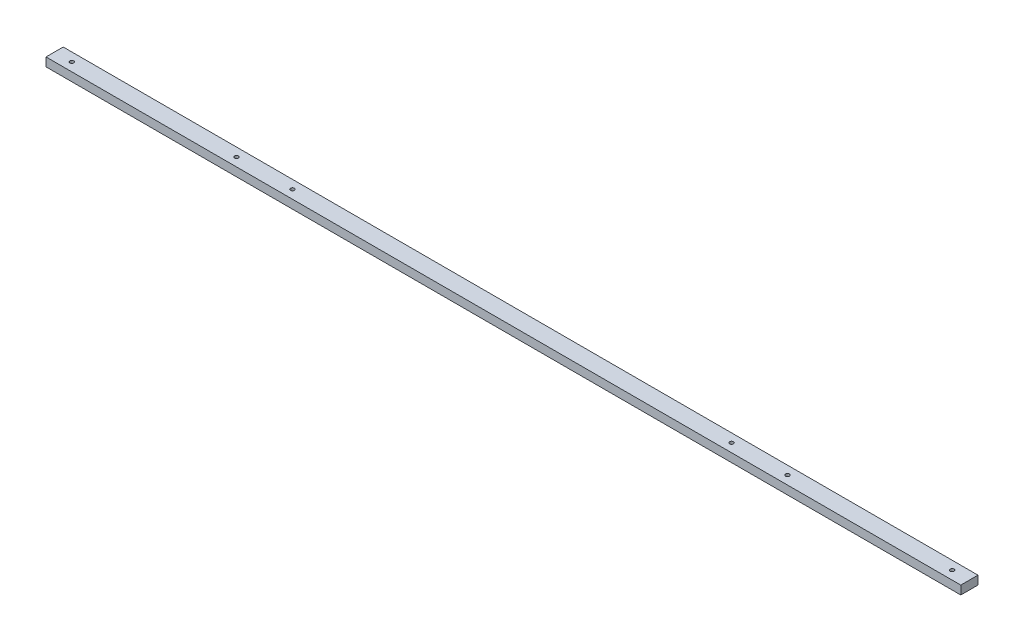
ISO-10303-21;
HEADER;
FILE_DESCRIPTION(('STEP AP214'),'2;1');
FILE_NAME('part.step','',(''),(''),'','','');
FILE_SCHEMA(('AUTOMOTIVE_DESIGN { 1 0 10303 214 1 1 1 1 }'));
ENDSEC;
DATA;
#1=APPLICATION_CONTEXT('core data for automotive mechanical design processes');
#2=APPLICATION_PROTOCOL_DEFINITION('international standard','automotive_design',2000,#1);
#3=PRODUCT_CONTEXT('',#1,'mechanical');
#4=PRODUCT('Part','Part','',(#3));
#5=PRODUCT_RELATED_PRODUCT_CATEGORY('part','',(#4));
#6=PRODUCT_DEFINITION_FORMATION('','',#4);
#7=PRODUCT_DEFINITION_CONTEXT('part definition',#1,'design');
#8=PRODUCT_DEFINITION('design','',#6,#7);
#9=PRODUCT_DEFINITION_SHAPE('','',#8);
#10=(LENGTH_UNIT() NAMED_UNIT(*) SI_UNIT(.MILLI.,.METRE.));
#11=(NAMED_UNIT(*) PLANE_ANGLE_UNIT() SI_UNIT($,.RADIAN.));
#12=(NAMED_UNIT(*) SI_UNIT($,.STERADIAN.) SOLID_ANGLE_UNIT());
#13=UNCERTAINTY_MEASURE_WITH_UNIT(LENGTH_MEASURE(1.E-05),#10,'distance_accuracy_value','');
#14=(GEOMETRIC_REPRESENTATION_CONTEXT(3) GLOBAL_UNCERTAINTY_ASSIGNED_CONTEXT((#13)) GLOBAL_UNIT_ASSIGNED_CONTEXT((#10,
#11,#12)) REPRESENTATION_CONTEXT('',''));
#15=CARTESIAN_POINT('',(0.,0.,0.));
#16=DIRECTION('',(0.,0.,1.));
#17=DIRECTION('',(1.,0.,0.));
#18=AXIS2_PLACEMENT_3D('',#15,#16,#17);
#19=CARTESIAN_POINT('',(337.34375,3.175,6.34999999999999));
#20=DIRECTION('',(0.,0.,-1.));
#21=DIRECTION('',(0.,1.,0.));
#22=AXIS2_PLACEMENT_3D('',#19,#20,#21);
#23=PLANE('',#22);
#24=DIRECTION('',(0.,-1.,0.));
#25=VECTOR('',#24,1.);
#26=CARTESIAN_POINT('',(-337.34375,3.175,6.34999999999999));
#27=LINE('',#26,#25);
#28=CARTESIAN_POINT('',(-337.34375,3.175,6.34999999999999));
#29=VERTEX_POINT('',#28);
#30=CARTESIAN_POINT('',(-337.34375,-3.175,6.34999999999999));
#31=VERTEX_POINT('',#30);
#32=EDGE_CURVE('E95',#29,#31,#27,.T.);
#33=ORIENTED_EDGE('',*,*,#32,.T.);
#34=DIRECTION('',(-1.,0.,0.));
#35=VECTOR('',#34,1.);
#36=CARTESIAN_POINT('',(337.34375,-3.175,6.34999999999999));
#37=LINE('',#36,#35);
#38=CARTESIAN_POINT('',(337.34375,-3.175,6.34999999999999));
#39=VERTEX_POINT('',#38);
#40=EDGE_CURVE('E11',#39,#31,#37,.T.);
#41=ORIENTED_EDGE('',*,*,#40,.F.);
#42=DIRECTION('',(0.,-1.,0.));
#43=VECTOR('',#42,1.);
#44=CARTESIAN_POINT('',(337.34375,3.175,6.34999999999999));
#45=LINE('',#44,#43);
#46=CARTESIAN_POINT('',(337.34375,3.175,6.34999999999999));
#47=VERTEX_POINT('',#46);
#48=EDGE_CURVE('E83',#47,#39,#45,.T.);
#49=ORIENTED_EDGE('',*,*,#48,.F.);
#50=DIRECTION('',(-1.,0.,0.));
#51=VECTOR('',#50,1.);
#52=CARTESIAN_POINT('',(337.34375,3.175,6.34999999999999));
#53=LINE('',#52,#51);
#54=EDGE_CURVE('E91',#47,#29,#53,.T.);
#55=ORIENTED_EDGE('',*,*,#54,.T.);
#56=EDGE_LOOP('',(#33,#41,#49,#55));
#57=FACE_BOUND('',#56,.T.);
#58=ADVANCED_FACE('F32',(#57),#23,.F.);
#59=CARTESIAN_POINT('',(337.34375,-3.175,6.34999999999999));
#60=DIRECTION('',(0.,1.,0.));
#61=DIRECTION('',(0.,0.,1.));
#62=AXIS2_PLACEMENT_3D('',#59,#60,#61);
#63=PLANE('',#62);
#64=CARTESIAN_POINT('',(-324.64375,-3.175,0.));
#65=DIRECTION('',(0.,1.,0.));
#66=DIRECTION('',(0.,0.,-1.));
#67=AXIS2_PLACEMENT_3D('',#64,#65,#66);
#68=CIRCLE('',#67,1.42240000000005);
#69=CARTESIAN_POINT('',(-324.64375,-3.175,-1.42240000000005));
#70=VERTEX_POINT('',#69);
#71=EDGE_CURVE('E136',#70,#70,#68,.T.);
#72=ORIENTED_EDGE('',*,*,#71,.T.);
#73=EDGE_LOOP('',(#72));
#74=FACE_BOUND('',#73,.T.);
#75=CARTESIAN_POINT('',(324.64375,-3.175,0.));
#76=DIRECTION('',(0.,1.,0.));
#77=DIRECTION('',(0.,0.,1.));
#78=AXIS2_PLACEMENT_3D('',#75,#76,#77);
#79=CIRCLE('',#78,1.42240000000005);
#80=CARTESIAN_POINT('',(324.64375,-3.175,1.42240000000005));
#81=VERTEX_POINT('',#80);
#82=EDGE_CURVE('E130',#81,#81,#79,.T.);
#83=ORIENTED_EDGE('',*,*,#82,.T.);
#84=EDGE_LOOP('',(#83));
#85=FACE_BOUND('',#84,.T.);
#86=CARTESIAN_POINT('',(-161.925,-3.175,0.));
#87=DIRECTION('',(0.,1.,0.));
#88=DIRECTION('',(0.,0.,-1.));
#89=AXIS2_PLACEMENT_3D('',#86,#87,#88);
#90=CIRCLE('',#89,1.42239999999999);
#91=CARTESIAN_POINT('',(-161.925,-3.175,-1.42239999999999));
#92=VERTEX_POINT('',#91);
#93=EDGE_CURVE('E124',#92,#92,#90,.T.);
#94=ORIENTED_EDGE('',*,*,#93,.T.);
#95=EDGE_LOOP('',(#94));
#96=FACE_BOUND('',#95,.T.);
#97=CARTESIAN_POINT('',(-203.2,-3.175,0.));
#98=DIRECTION('',(0.,1.,0.));
#99=DIRECTION('',(0.,0.,-1.));
#100=AXIS2_PLACEMENT_3D('',#97,#98,#99);
#101=CIRCLE('',#100,1.42239999999999);
#102=CARTESIAN_POINT('',(-203.2,-3.175,-1.42239999999999));
#103=VERTEX_POINT('',#102);
#104=EDGE_CURVE('E118',#103,#103,#101,.T.);
#105=ORIENTED_EDGE('',*,*,#104,.T.);
#106=EDGE_LOOP('',(#105));
#107=FACE_BOUND('',#106,.T.);
#108=CARTESIAN_POINT('',(203.2,-3.175,0.));
#109=DIRECTION('',(0.,1.,0.));
#110=DIRECTION('',(0.,0.,1.));
#111=AXIS2_PLACEMENT_3D('',#108,#109,#110);
#112=CIRCLE('',#111,1.42239999999999);
#113=CARTESIAN_POINT('',(203.2,-3.175,1.42239999999999));
#114=VERTEX_POINT('',#113);
#115=EDGE_CURVE('E112',#114,#114,#112,.T.);
#116=ORIENTED_EDGE('',*,*,#115,.T.);
#117=EDGE_LOOP('',(#116));
#118=FACE_BOUND('',#117,.T.);
#119=CARTESIAN_POINT('',(161.925,-3.175,0.));
#120=DIRECTION('',(0.,1.,0.));
#121=DIRECTION('',(0.,0.,1.));
#122=AXIS2_PLACEMENT_3D('',#119,#120,#121);
#123=CIRCLE('',#122,1.42239999999999);
#124=CARTESIAN_POINT('',(161.925,-3.175,1.42239999999999));
#125=VERTEX_POINT('',#124);
#126=EDGE_CURVE('E98',#125,#125,#123,.T.);
#127=ORIENTED_EDGE('',*,*,#126,.T.);
#128=EDGE_LOOP('',(#127));
#129=FACE_BOUND('',#128,.T.);
#130=DIRECTION('',(0.,0.,-1.));
#131=VECTOR('',#130,1.);
#132=CARTESIAN_POINT('',(-337.34375,-3.175,6.34999999999999));
#133=LINE('',#132,#131);
#134=CARTESIAN_POINT('',(-337.34375,-3.175,-6.34999999999999));
#135=VERTEX_POINT('',#134);
#136=EDGE_CURVE('E87',#31,#135,#133,.T.);
#137=ORIENTED_EDGE('',*,*,#136,.T.);
#138=DIRECTION('',(-1.,0.,0.));
#139=VECTOR('',#138,1.);
#140=CARTESIAN_POINT('',(337.34375,-3.175,-6.34999999999999));
#141=LINE('',#140,#139);
#142=CARTESIAN_POINT('',(337.34375,-3.175,-6.34999999999999));
#143=VERTEX_POINT('',#142);
#144=EDGE_CURVE('E40',#143,#135,#141,.T.);
#145=ORIENTED_EDGE('',*,*,#144,.F.);
#146=DIRECTION('',(0.,0.,-1.));
#147=VECTOR('',#146,1.);
#148=CARTESIAN_POINT('',(337.34375,-3.175,6.34999999999999));
#149=LINE('',#148,#147);
#150=EDGE_CURVE('E78',#39,#143,#149,.T.);
#151=ORIENTED_EDGE('',*,*,#150,.F.);
#152=ORIENTED_EDGE('',*,*,#40,.T.);
#153=EDGE_LOOP('',(#137,#145,#151,#152));
#154=FACE_BOUND('',#153,.T.);
#155=ADVANCED_FACE('F86',(#74,#85,#96,#107,#118,#129,#154),#63,.F.);
#156=CARTESIAN_POINT('',(337.34375,3.175,-6.34999999999999));
#157=DIRECTION('',(0.,0.,1.));
#158=DIRECTION('',(0.,-1.,0.));
#159=AXIS2_PLACEMENT_3D('',#156,#157,#158);
#160=PLANE('',#159);
#161=DIRECTION('',(0.,1.,0.));
#162=VECTOR('',#161,1.);
#163=CARTESIAN_POINT('',(-337.34375,3.175,-6.34999999999999));
#164=LINE('',#163,#162);
#165=CARTESIAN_POINT('',(-337.34375,3.175,-6.34999999999999));
#166=VERTEX_POINT('',#165);
#167=EDGE_CURVE('E65',#135,#166,#164,.T.);
#168=ORIENTED_EDGE('',*,*,#167,.T.);
#169=DIRECTION('',(-1.,0.,0.));
#170=VECTOR('',#169,1.);
#171=CARTESIAN_POINT('',(337.34375,3.175,-6.34999999999999));
#172=LINE('',#171,#170);
#173=CARTESIAN_POINT('',(337.34375,3.175,-6.34999999999999));
#174=VERTEX_POINT('',#173);
#175=EDGE_CURVE('E88',#174,#166,#172,.T.);
#176=ORIENTED_EDGE('',*,*,#175,.F.);
#177=DIRECTION('',(0.,1.,0.));
#178=VECTOR('',#177,1.);
#179=CARTESIAN_POINT('',(337.34375,3.175,-6.34999999999999));
#180=LINE('',#179,#178);
#181=EDGE_CURVE('E81',#143,#174,#180,.T.);
#182=ORIENTED_EDGE('',*,*,#181,.F.);
#183=ORIENTED_EDGE('',*,*,#144,.T.);
#184=EDGE_LOOP('',(#168,#176,#182,#183));
#185=FACE_BOUND('',#184,.T.);
#186=ADVANCED_FACE('F89',(#185),#160,.F.);
#187=CARTESIAN_POINT('',(337.34375,3.175,6.34999999999999));
#188=DIRECTION('',(0.,-1.,0.));
#189=DIRECTION('',(0.,0.,-1.));
#190=AXIS2_PLACEMENT_3D('',#187,#188,#189);
#191=PLANE('',#190);
#192=CARTESIAN_POINT('',(-324.64375,3.175,0.));
#193=DIRECTION('',(0.,1.,0.));
#194=DIRECTION('',(0.,0.,-1.));
#195=AXIS2_PLACEMENT_3D('',#192,#193,#194);
#196=CIRCLE('',#195,1.42240000000005);
#197=CARTESIAN_POINT('',(-324.64375,3.175,-1.42240000000005));
#198=VERTEX_POINT('',#197);
#199=EDGE_CURVE('E139',#198,#198,#196,.T.);
#200=ORIENTED_EDGE('',*,*,#199,.F.);
#201=EDGE_LOOP('',(#200));
#202=FACE_BOUND('',#201,.T.);
#203=CARTESIAN_POINT('',(324.64375,3.175,0.));
#204=DIRECTION('',(0.,1.,0.));
#205=DIRECTION('',(0.,0.,1.));
#206=AXIS2_PLACEMENT_3D('',#203,#204,#205);
#207=CIRCLE('',#206,1.42240000000005);
#208=CARTESIAN_POINT('',(324.64375,3.175,1.42240000000005));
#209=VERTEX_POINT('',#208);
#210=EDGE_CURVE('E133',#209,#209,#207,.T.);
#211=ORIENTED_EDGE('',*,*,#210,.F.);
#212=EDGE_LOOP('',(#211));
#213=FACE_BOUND('',#212,.T.);
#214=CARTESIAN_POINT('',(-161.925,3.175,0.));
#215=DIRECTION('',(0.,1.,0.));
#216=DIRECTION('',(0.,0.,-1.));
#217=AXIS2_PLACEMENT_3D('',#214,#215,#216);
#218=CIRCLE('',#217,1.42239999999999);
#219=CARTESIAN_POINT('',(-161.925,3.175,-1.42239999999999));
#220=VERTEX_POINT('',#219);
#221=EDGE_CURVE('E127',#220,#220,#218,.T.);
#222=ORIENTED_EDGE('',*,*,#221,.F.);
#223=EDGE_LOOP('',(#222));
#224=FACE_BOUND('',#223,.T.);
#225=CARTESIAN_POINT('',(-203.2,3.175,0.));
#226=DIRECTION('',(0.,1.,0.));
#227=DIRECTION('',(0.,0.,-1.));
#228=AXIS2_PLACEMENT_3D('',#225,#226,#227);
#229=CIRCLE('',#228,1.42239999999999);
#230=CARTESIAN_POINT('',(-203.2,3.175,-1.42239999999999));
#231=VERTEX_POINT('',#230);
#232=EDGE_CURVE('E121',#231,#231,#229,.T.);
#233=ORIENTED_EDGE('',*,*,#232,.F.);
#234=EDGE_LOOP('',(#233));
#235=FACE_BOUND('',#234,.T.);
#236=CARTESIAN_POINT('',(203.2,3.175,0.));
#237=DIRECTION('',(0.,1.,0.));
#238=DIRECTION('',(0.,0.,1.));
#239=AXIS2_PLACEMENT_3D('',#236,#237,#238);
#240=CIRCLE('',#239,1.42239999999999);
#241=CARTESIAN_POINT('',(203.2,3.175,1.42239999999999));
#242=VERTEX_POINT('',#241);
#243=EDGE_CURVE('E115',#242,#242,#240,.T.);
#244=ORIENTED_EDGE('',*,*,#243,.F.);
#245=EDGE_LOOP('',(#244));
#246=FACE_BOUND('',#245,.T.);
#247=CARTESIAN_POINT('',(161.925,3.175,0.));
#248=DIRECTION('',(0.,1.,0.));
#249=DIRECTION('',(0.,0.,1.));
#250=AXIS2_PLACEMENT_3D('',#247,#248,#249);
#251=CIRCLE('',#250,1.42239999999999);
#252=CARTESIAN_POINT('',(161.925,3.175,1.42239999999999));
#253=VERTEX_POINT('',#252);
#254=EDGE_CURVE('E109',#253,#253,#251,.T.);
#255=ORIENTED_EDGE('',*,*,#254,.F.);
#256=EDGE_LOOP('',(#255));
#257=FACE_BOUND('',#256,.T.);
#258=DIRECTION('',(0.,0.,1.));
#259=VECTOR('',#258,1.);
#260=CARTESIAN_POINT('',(-337.34375,3.175,6.34999999999999));
#261=LINE('',#260,#259);
#262=EDGE_CURVE('E71',#166,#29,#261,.T.);
#263=ORIENTED_EDGE('',*,*,#262,.T.);
#264=ORIENTED_EDGE('',*,*,#54,.F.);
#265=DIRECTION('',(0.,0.,1.));
#266=VECTOR('',#265,1.);
#267=CARTESIAN_POINT('',(337.34375,3.175,6.34999999999999));
#268=LINE('',#267,#266);
#269=EDGE_CURVE('E48',#174,#47,#268,.T.);
#270=ORIENTED_EDGE('',*,*,#269,.F.);
#271=ORIENTED_EDGE('',*,*,#175,.T.);
#272=EDGE_LOOP('',(#263,#264,#270,#271));
#273=FACE_BOUND('',#272,.T.);
#274=ADVANCED_FACE('F103',(#202,#213,#224,#235,#246,#257,#273),#191,.F.);
#275=CARTESIAN_POINT('',(337.34375,-3.175,6.34999999999999));
#276=DIRECTION('',(1.,0.,0.));
#277=DIRECTION('',(0.,0.,-1.));
#278=AXIS2_PLACEMENT_3D('',#275,#276,#277);
#279=PLANE('',#278);
#280=ORIENTED_EDGE('',*,*,#48,.T.);
#281=ORIENTED_EDGE('',*,*,#150,.T.);
#282=ORIENTED_EDGE('',*,*,#181,.T.);
#283=ORIENTED_EDGE('',*,*,#269,.T.);
#284=EDGE_LOOP('',(#280,#281,#282,#283));
#285=FACE_BOUND('',#284,.T.);
#286=ADVANCED_FACE('F79',(#285),#279,.T.);
#287=CARTESIAN_POINT('',(-337.34375,-3.175,6.34999999999999));
#288=DIRECTION('',(1.,0.,0.));
#289=DIRECTION('',(0.,0.,-1.));
#290=AXIS2_PLACEMENT_3D('',#287,#288,#289);
#291=PLANE('',#290);
#292=ORIENTED_EDGE('',*,*,#32,.F.);
#293=ORIENTED_EDGE('',*,*,#262,.F.);
#294=ORIENTED_EDGE('',*,*,#167,.F.);
#295=ORIENTED_EDGE('',*,*,#136,.F.);
#296=EDGE_LOOP('',(#292,#293,#294,#295));
#297=FACE_BOUND('',#296,.T.);
#298=ADVANCED_FACE('F106',(#297),#291,.F.);
#299=CARTESIAN_POINT('',(161.925,-3.175,0.));
#300=DIRECTION('',(0.,1.,0.));
#301=DIRECTION('',(0.,0.,1.));
#302=AXIS2_PLACEMENT_3D('',#299,#300,#301);
#303=CYLINDRICAL_SURFACE('',#302,1.42239999999999);
#304=ORIENTED_EDGE('',*,*,#126,.F.);
#305=EDGE_LOOP('',(#304));
#306=FACE_BOUND('',#305,.T.);
#307=ORIENTED_EDGE('',*,*,#254,.T.);
#308=EDGE_LOOP('',(#307));
#309=FACE_BOUND('',#308,.T.);
#310=ADVANCED_FACE('F167',(#306,#309),#303,.F.);
#311=CARTESIAN_POINT('',(203.2,-3.175,0.));
#312=DIRECTION('',(0.,1.,0.));
#313=DIRECTION('',(0.,0.,1.));
#314=AXIS2_PLACEMENT_3D('',#311,#312,#313);
#315=CYLINDRICAL_SURFACE('',#314,1.42239999999999);
#316=ORIENTED_EDGE('',*,*,#115,.F.);
#317=EDGE_LOOP('',(#316));
#318=FACE_BOUND('',#317,.T.);
#319=ORIENTED_EDGE('',*,*,#243,.T.);
#320=EDGE_LOOP('',(#319));
#321=FACE_BOUND('',#320,.T.);
#322=ADVANCED_FACE('F169',(#318,#321),#315,.F.);
#323=CARTESIAN_POINT('',(-203.2,-3.175,0.));
#324=DIRECTION('',(0.,1.,0.));
#325=DIRECTION('',(0.,0.,1.));
#326=AXIS2_PLACEMENT_3D('',#323,#324,#325);
#327=CYLINDRICAL_SURFACE('',#326,1.42239999999999);
#328=ORIENTED_EDGE('',*,*,#104,.F.);
#329=EDGE_LOOP('',(#328));
#330=FACE_BOUND('',#329,.T.);
#331=ORIENTED_EDGE('',*,*,#232,.T.);
#332=EDGE_LOOP('',(#331));
#333=FACE_BOUND('',#332,.T.);
#334=ADVANCED_FACE('F176',(#330,#333),#327,.F.);
#335=CARTESIAN_POINT('',(-161.925,-3.175,0.));
#336=DIRECTION('',(0.,1.,0.));
#337=DIRECTION('',(0.,0.,1.));
#338=AXIS2_PLACEMENT_3D('',#335,#336,#337);
#339=CYLINDRICAL_SURFACE('',#338,1.42239999999999);
#340=ORIENTED_EDGE('',*,*,#93,.F.);
#341=EDGE_LOOP('',(#340));
#342=FACE_BOUND('',#341,.T.);
#343=ORIENTED_EDGE('',*,*,#221,.T.);
#344=EDGE_LOOP('',(#343));
#345=FACE_BOUND('',#344,.T.);
#346=ADVANCED_FACE('F218',(#342,#345),#339,.F.);
#347=CARTESIAN_POINT('',(324.64375,-3.175,0.));
#348=DIRECTION('',(0.,1.,0.));
#349=DIRECTION('',(0.,0.,1.));
#350=AXIS2_PLACEMENT_3D('',#347,#348,#349);
#351=CYLINDRICAL_SURFACE('',#350,1.42240000000005);
#352=ORIENTED_EDGE('',*,*,#82,.F.);
#353=EDGE_LOOP('',(#352));
#354=FACE_BOUND('',#353,.T.);
#355=ORIENTED_EDGE('',*,*,#210,.T.);
#356=EDGE_LOOP('',(#355));
#357=FACE_BOUND('',#356,.T.);
#358=ADVANCED_FACE('F150',(#354,#357),#351,.F.);
#359=CARTESIAN_POINT('',(-324.64375,-3.175,0.));
#360=DIRECTION('',(0.,1.,0.));
#361=DIRECTION('',(0.,0.,1.));
#362=AXIS2_PLACEMENT_3D('',#359,#360,#361);
#363=CYLINDRICAL_SURFACE('',#362,1.42240000000005);
#364=ORIENTED_EDGE('',*,*,#71,.F.);
#365=EDGE_LOOP('',(#364));
#366=FACE_BOUND('',#365,.T.);
#367=ORIENTED_EDGE('',*,*,#199,.T.);
#368=EDGE_LOOP('',(#367));
#369=FACE_BOUND('',#368,.T.);
#370=ADVANCED_FACE('F147',(#366,#369),#363,.F.);
#371=CLOSED_SHELL('',(#58,#155,#186,#274,#286,#298,#310,#322,#334,#346,#358,#370));
#372=MANIFOLD_SOLID_BREP('B2',#371);
#373=ADVANCED_BREP_SHAPE_REPRESENTATION('',(#18,#372),#14);
#374=SHAPE_DEFINITION_REPRESENTATION(#9,#373);
ENDSEC;
END-ISO-10303-21;
